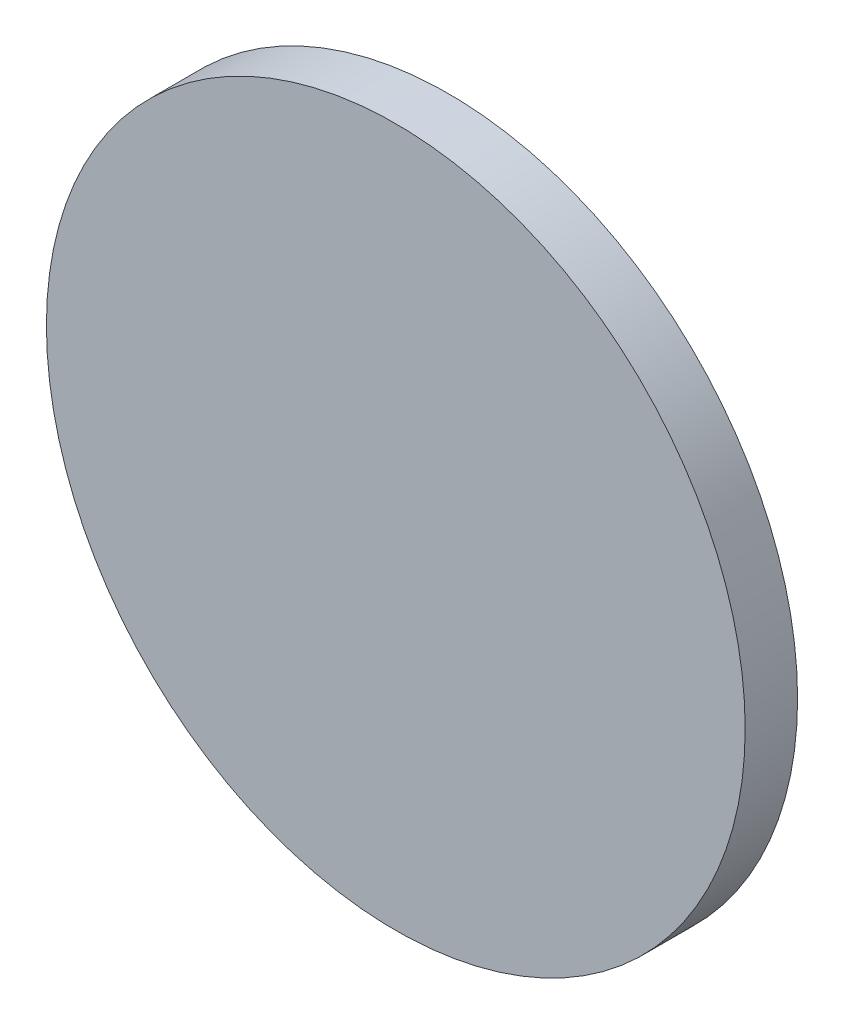
ISO-10303-21;
HEADER;
FILE_DESCRIPTION(('STEP AP214'),'2;1');
FILE_NAME('part.step','',(''),(''),'','','');
FILE_SCHEMA(('AUTOMOTIVE_DESIGN { 1 0 10303 214 1 1 1 1 }'));
ENDSEC;
DATA;
#1=APPLICATION_CONTEXT('core data for automotive mechanical design processes');
#2=APPLICATION_PROTOCOL_DEFINITION('international standard','automotive_design',2000,#1);
#3=PRODUCT_CONTEXT('',#1,'mechanical');
#4=PRODUCT('Part','Part','',(#3));
#5=PRODUCT_RELATED_PRODUCT_CATEGORY('part','',(#4));
#6=PRODUCT_DEFINITION_FORMATION('','',#4);
#7=PRODUCT_DEFINITION_CONTEXT('part definition',#1,'design');
#8=PRODUCT_DEFINITION('design','',#6,#7);
#9=PRODUCT_DEFINITION_SHAPE('','',#8);
#10=(LENGTH_UNIT() NAMED_UNIT(*) SI_UNIT(.MILLI.,.METRE.));
#11=(NAMED_UNIT(*) PLANE_ANGLE_UNIT() SI_UNIT($,.RADIAN.));
#12=(NAMED_UNIT(*) SI_UNIT($,.STERADIAN.) SOLID_ANGLE_UNIT());
#13=UNCERTAINTY_MEASURE_WITH_UNIT(LENGTH_MEASURE(1.E-05),#10,'distance_accuracy_value','');
#14=(GEOMETRIC_REPRESENTATION_CONTEXT(3) GLOBAL_UNCERTAINTY_ASSIGNED_CONTEXT((#13)) GLOBAL_UNIT_ASSIGNED_CONTEXT((#10,
#11,#12)) REPRESENTATION_CONTEXT('',''));
#15=CARTESIAN_POINT('',(0.,0.,0.));
#16=DIRECTION('',(0.,0.,1.));
#17=DIRECTION('',(1.,0.,0.));
#18=AXIS2_PLACEMENT_3D('',#15,#16,#17);
#19=CARTESIAN_POINT('',(6.25832,13.13982,0.79916));
#20=DIRECTION('',(0.,0.,1.));
#21=DIRECTION('',(1.,0.,0.));
#22=AXIS2_PLACEMENT_3D('',#19,#20,#21);
#23=PLANE('',#22);
#24=CARTESIAN_POINT('',(6.25832,13.13982,0.79916));
#25=DIRECTION('',(0.,0.,1.));
#26=DIRECTION('',(1.,0.,0.));
#27=AXIS2_PLACEMENT_3D('',#24,#25,#26);
#28=CIRCLE('',#27,0.2286);
#29=CARTESIAN_POINT('',(6.48692,13.13982,0.79916));
#30=VERTEX_POINT('',#29);
#31=EDGE_CURVE('E18',#30,#30,#28,.F.);
#32=ORIENTED_EDGE('',*,*,#31,.F.);
#33=EDGE_LOOP('',(#32));
#34=FACE_BOUND('',#33,.T.);
#35=ADVANCED_FACE('F15',(#34),#23,.T.);
#36=CARTESIAN_POINT('',(6.25832,13.13982,0.76487));
#37=DIRECTION('',(0.,0.,1.));
#38=DIRECTION('',(1.,0.,0.));
#39=AXIS2_PLACEMENT_3D('',#36,#37,#38);
#40=CYLINDRICAL_SURFACE('',#39,0.2286);
#41=ORIENTED_EDGE('',*,*,#31,.T.);
#42=EDGE_LOOP('',(#41));
#43=FACE_BOUND('',#42,.T.);
#44=CARTESIAN_POINT('',(6.25832,13.13982,0.76487));
#45=DIRECTION('',(0.,0.,1.));
#46=DIRECTION('',(1.,0.,0.));
#47=AXIS2_PLACEMENT_3D('',#44,#45,#46);
#48=CIRCLE('',#47,0.2286);
#49=CARTESIAN_POINT('',(6.48692,13.13982,0.76487));
#50=VERTEX_POINT('',#49);
#51=EDGE_CURVE('E10',#50,#50,#48,.F.);
#52=ORIENTED_EDGE('',*,*,#51,.F.);
#53=EDGE_LOOP('',(#52));
#54=FACE_BOUND('',#53,.T.);
#55=ADVANCED_FACE('F27',(#43,#54),#40,.T.);
#56=CARTESIAN_POINT('',(6.25832,13.13982,0.76487));
#57=DIRECTION('',(0.,0.,-1.));
#58=DIRECTION('',(-1.,0.,0.));
#59=AXIS2_PLACEMENT_3D('',#56,#57,#58);
#60=PLANE('',#59);
#61=ORIENTED_EDGE('',*,*,#51,.T.);
#62=EDGE_LOOP('',(#61));
#63=FACE_BOUND('',#62,.T.);
#64=ADVANCED_FACE('F35',(#63),#60,.T.);
#65=CLOSED_SHELL('',(#35,#55,#64));
#66=MANIFOLD_SOLID_BREP('B1',#65);
#67=ADVANCED_BREP_SHAPE_REPRESENTATION('',(#18,#66),#14);
#68=SHAPE_DEFINITION_REPRESENTATION(#9,#67);
ENDSEC;
END-ISO-10303-21;
